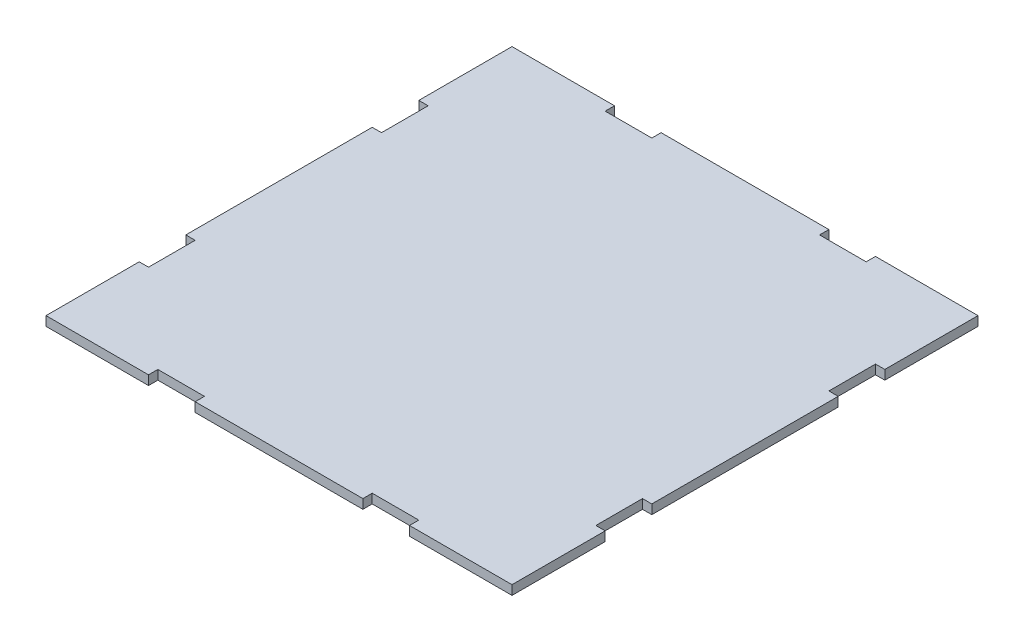
ISO-10303-21;
HEADER;
FILE_DESCRIPTION(('STEP AP214'),'2;1');
FILE_NAME('part.step','',(''),(''),'','','');
FILE_SCHEMA(('AUTOMOTIVE_DESIGN { 1 0 10303 214 1 1 1 1 }'));
ENDSEC;
DATA;
#1=APPLICATION_CONTEXT('core data for automotive mechanical design processes');
#2=APPLICATION_PROTOCOL_DEFINITION('international standard','automotive_design',2000,#1);
#3=PRODUCT_CONTEXT('',#1,'mechanical');
#4=PRODUCT('Part','Part','',(#3));
#5=PRODUCT_RELATED_PRODUCT_CATEGORY('part','',(#4));
#6=PRODUCT_DEFINITION_FORMATION('','',#4);
#7=PRODUCT_DEFINITION_CONTEXT('part definition',#1,'design');
#8=PRODUCT_DEFINITION('design','',#6,#7);
#9=PRODUCT_DEFINITION_SHAPE('','',#8);
#10=(LENGTH_UNIT() NAMED_UNIT(*) SI_UNIT(.MILLI.,.METRE.));
#11=(NAMED_UNIT(*) PLANE_ANGLE_UNIT() SI_UNIT($,.RADIAN.));
#12=(NAMED_UNIT(*) SI_UNIT($,.STERADIAN.) SOLID_ANGLE_UNIT());
#13=UNCERTAINTY_MEASURE_WITH_UNIT(LENGTH_MEASURE(1.E-05),#10,'distance_accuracy_value','');
#14=(GEOMETRIC_REPRESENTATION_CONTEXT(3) GLOBAL_UNCERTAINTY_ASSIGNED_CONTEXT((#13)) GLOBAL_UNIT_ASSIGNED_CONTEXT((#10,
#11,#12)) REPRESENTATION_CONTEXT('',''));
#15=CARTESIAN_POINT('',(0.,0.,0.));
#16=DIRECTION('',(0.,0.,1.));
#17=DIRECTION('',(1.,0.,0.));
#18=AXIS2_PLACEMENT_3D('',#15,#16,#17);
#19=CARTESIAN_POINT('',(0.,0.,0.));
#20=DIRECTION('',(0.,1.,0.));
#21=DIRECTION('',(0.,0.,1.));
#22=AXIS2_PLACEMENT_3D('',#19,#20,#21);
#23=PLANE('',#22);
#24=DIRECTION('',(0.,0.,-1.));
#25=VECTOR('',#24,1.);
#26=CARTESIAN_POINT('',(-18.,0.,48.));
#27=LINE('',#26,#25);
#28=CARTESIAN_POINT('',(-18.,0.,50.));
#29=VERTEX_POINT('',#28);
#30=CARTESIAN_POINT('',(-18.,0.,48.));
#31=VERTEX_POINT('',#30);
#32=EDGE_CURVE('E300',#29,#31,#27,.T.);
#33=ORIENTED_EDGE('',*,*,#32,.T.);
#34=DIRECTION('',(-1.,0.,0.));
#35=VECTOR('',#34,1.);
#36=CARTESIAN_POINT('',(-28.,0.,48.));
#37=LINE('',#36,#35);
#38=CARTESIAN_POINT('',(-28.,0.,48.));
#39=VERTEX_POINT('',#38);
#40=EDGE_CURVE('E303',#31,#39,#37,.T.);
#41=ORIENTED_EDGE('',*,*,#40,.T.);
#42=DIRECTION('',(0.,0.,1.));
#43=VECTOR('',#42,1.);
#44=CARTESIAN_POINT('',(-28.,0.,48.));
#45=LINE('',#44,#43);
#46=CARTESIAN_POINT('',(-28.,0.,50.));
#47=VERTEX_POINT('',#46);
#48=EDGE_CURVE('E307',#39,#47,#45,.T.);
#49=ORIENTED_EDGE('',*,*,#48,.T.);
#50=DIRECTION('',(1.,0.,0.));
#51=VECTOR('',#50,1.);
#52=CARTESIAN_POINT('',(-50.,0.,50.));
#53=LINE('',#52,#51);
#54=CARTESIAN_POINT('',(-50.,0.,50.));
#55=VERTEX_POINT('',#54);
#56=EDGE_CURVE('E490',#55,#47,#53,.T.);
#57=ORIENTED_EDGE('',*,*,#56,.F.);
#58=DIRECTION('',(0.,0.,1.));
#59=VECTOR('',#58,1.);
#60=CARTESIAN_POINT('',(-50.,0.,-50.));
#61=LINE('',#60,#59);
#62=CARTESIAN_POINT('',(-50.,0.,30.));
#63=VERTEX_POINT('',#62);
#64=EDGE_CURVE('E489',#63,#55,#61,.T.);
#65=ORIENTED_EDGE('',*,*,#64,.F.);
#66=DIRECTION('',(-1.,0.,0.));
#67=VECTOR('',#66,1.);
#68=CARTESIAN_POINT('',(-50.,0.,30.));
#69=LINE('',#68,#67);
#70=CARTESIAN_POINT('',(-48.,0.,30.));
#71=VERTEX_POINT('',#70);
#72=EDGE_CURVE('E375',#71,#63,#69,.T.);
#73=ORIENTED_EDGE('',*,*,#72,.F.);
#74=DIRECTION('',(0.,0.,1.));
#75=VECTOR('',#74,1.);
#76=CARTESIAN_POINT('',(-48.,0.,30.));
#77=LINE('',#76,#75);
#78=CARTESIAN_POINT('',(-48.,0.,20.));
#79=VERTEX_POINT('',#78);
#80=EDGE_CURVE('E370',#79,#71,#77,.T.);
#81=ORIENTED_EDGE('',*,*,#80,.F.);
#82=DIRECTION('',(1.,0.,0.));
#83=VECTOR('',#82,1.);
#84=CARTESIAN_POINT('',(-50.,0.,20.));
#85=LINE('',#84,#83);
#86=CARTESIAN_POINT('',(-50.,0.,20.));
#87=VERTEX_POINT('',#86);
#88=EDGE_CURVE('E372',#87,#79,#85,.T.);
#89=ORIENTED_EDGE('',*,*,#88,.F.);
#90=CARTESIAN_POINT('',(-50.,0.,-20.));
#91=VERTEX_POINT('',#90);
#92=EDGE_CURVE('E488',#91,#87,#61,.T.);
#93=ORIENTED_EDGE('',*,*,#92,.F.);
#94=DIRECTION('',(1.,0.,0.));
#95=VECTOR('',#94,1.);
#96=CARTESIAN_POINT('',(-50.,0.,-20.));
#97=LINE('',#96,#95);
#98=CARTESIAN_POINT('',(-48.,0.,-20.));
#99=VERTEX_POINT('',#98);
#100=EDGE_CURVE('E395',#91,#99,#97,.T.);
#101=ORIENTED_EDGE('',*,*,#100,.T.);
#102=DIRECTION('',(0.,0.,-1.));
#103=VECTOR('',#102,1.);
#104=CARTESIAN_POINT('',(-48.,0.,-30.));
#105=LINE('',#104,#103);
#106=CARTESIAN_POINT('',(-48.,0.,-30.));
#107=VERTEX_POINT('',#106);
#108=EDGE_CURVE('E391',#99,#107,#105,.T.);
#109=ORIENTED_EDGE('',*,*,#108,.T.);
#110=DIRECTION('',(-1.,0.,0.));
#111=VECTOR('',#110,1.);
#112=CARTESIAN_POINT('',(-50.,0.,-30.));
#113=LINE('',#112,#111);
#114=CARTESIAN_POINT('',(-50.,0.,-30.));
#115=VERTEX_POINT('',#114);
#116=EDGE_CURVE('E394',#107,#115,#113,.T.);
#117=ORIENTED_EDGE('',*,*,#116,.T.);
#118=CARTESIAN_POINT('',(-50.,0.,-50.));
#119=VERTEX_POINT('',#118);
#120=EDGE_CURVE('E484',#119,#115,#61,.T.);
#121=ORIENTED_EDGE('',*,*,#120,.F.);
#122=DIRECTION('',(1.,0.,0.));
#123=VECTOR('',#122,1.);
#124=CARTESIAN_POINT('',(-50.,0.,-50.));
#125=LINE('',#124,#123);
#126=CARTESIAN_POINT('',(-28.,0.,-50.));
#127=VERTEX_POINT('',#126);
#128=EDGE_CURVE('E500',#119,#127,#125,.T.);
#129=ORIENTED_EDGE('',*,*,#128,.T.);
#130=DIRECTION('',(0.,0.,-1.));
#131=VECTOR('',#130,1.);
#132=CARTESIAN_POINT('',(-28.,0.,-50.));
#133=LINE('',#132,#131);
#134=CARTESIAN_POINT('',(-28.,0.,-48.));
#135=VERTEX_POINT('',#134);
#136=EDGE_CURVE('E326',#135,#127,#133,.T.);
#137=ORIENTED_EDGE('',*,*,#136,.F.);
#138=DIRECTION('',(-1.,0.,0.));
#139=VECTOR('',#138,1.);
#140=CARTESIAN_POINT('',(-28.,0.,-48.));
#141=LINE('',#140,#139);
#142=CARTESIAN_POINT('',(-18.,0.,-48.));
#143=VERTEX_POINT('',#142);
#144=EDGE_CURVE('E329',#143,#135,#141,.T.);
#145=ORIENTED_EDGE('',*,*,#144,.F.);
#146=DIRECTION('',(0.,0.,1.));
#147=VECTOR('',#146,1.);
#148=CARTESIAN_POINT('',(-18.,0.,-50.));
#149=LINE('',#148,#147);
#150=CARTESIAN_POINT('',(-18.,0.,-50.));
#151=VERTEX_POINT('',#150);
#152=EDGE_CURVE('E324',#151,#143,#149,.T.);
#153=ORIENTED_EDGE('',*,*,#152,.F.);
#154=CARTESIAN_POINT('',(18.,0.,-50.));
#155=VERTEX_POINT('',#154);
#156=EDGE_CURVE('E503',#151,#155,#125,.T.);
#157=ORIENTED_EDGE('',*,*,#156,.T.);
#158=DIRECTION('',(0.,0.,1.));
#159=VECTOR('',#158,1.);
#160=CARTESIAN_POINT('',(18.,0.,-50.));
#161=LINE('',#160,#159);
#162=CARTESIAN_POINT('',(18.,0.,-48.));
#163=VERTEX_POINT('',#162);
#164=EDGE_CURVE('E345',#155,#163,#161,.T.);
#165=ORIENTED_EDGE('',*,*,#164,.T.);
#166=DIRECTION('',(1.,0.,0.));
#167=VECTOR('',#166,1.);
#168=CARTESIAN_POINT('',(28.,0.,-48.));
#169=LINE('',#168,#167);
#170=CARTESIAN_POINT('',(28.,0.,-48.));
#171=VERTEX_POINT('',#170);
#172=EDGE_CURVE('E348',#163,#171,#169,.T.);
#173=ORIENTED_EDGE('',*,*,#172,.T.);
#174=DIRECTION('',(0.,0.,-1.));
#175=VECTOR('',#174,1.);
#176=CARTESIAN_POINT('',(28.,0.,-50.));
#177=LINE('',#176,#175);
#178=CARTESIAN_POINT('',(28.,0.,-50.));
#179=VERTEX_POINT('',#178);
#180=EDGE_CURVE('E352',#171,#179,#177,.T.);
#181=ORIENTED_EDGE('',*,*,#180,.T.);
#182=CARTESIAN_POINT('',(50.,0.,-50.));
#183=VERTEX_POINT('',#182);
#184=EDGE_CURVE('E498',#179,#183,#125,.T.);
#185=ORIENTED_EDGE('',*,*,#184,.T.);
#186=DIRECTION('',(0.,0.,1.));
#187=VECTOR('',#186,1.);
#188=CARTESIAN_POINT('',(50.,0.,-50.));
#189=LINE('',#188,#187);
#190=CARTESIAN_POINT('',(50.,0.,-30.));
#191=VERTEX_POINT('',#190);
#192=EDGE_CURVE('E495',#183,#191,#189,.T.);
#193=ORIENTED_EDGE('',*,*,#192,.T.);
#194=DIRECTION('',(1.,0.,0.));
#195=VECTOR('',#194,1.);
#196=CARTESIAN_POINT('',(50.,0.,-30.));
#197=LINE('',#196,#195);
#198=CARTESIAN_POINT('',(48.,0.,-30.));
#199=VERTEX_POINT('',#198);
#200=EDGE_CURVE('E422',#199,#191,#197,.T.);
#201=ORIENTED_EDGE('',*,*,#200,.F.);
#202=DIRECTION('',(0.,0.,-1.));
#203=VECTOR('',#202,1.);
#204=CARTESIAN_POINT('',(48.,0.,-30.));
#205=LINE('',#204,#203);
#206=CARTESIAN_POINT('',(48.,0.,-20.));
#207=VERTEX_POINT('',#206);
#208=EDGE_CURVE('E416',#207,#199,#205,.T.);
#209=ORIENTED_EDGE('',*,*,#208,.F.);
#210=DIRECTION('',(-1.,0.,0.));
#211=VECTOR('',#210,1.);
#212=CARTESIAN_POINT('',(50.,0.,-20.));
#213=LINE('',#212,#211);
#214=CARTESIAN_POINT('',(50.,0.,-20.));
#215=VERTEX_POINT('',#214);
#216=EDGE_CURVE('E419',#215,#207,#213,.T.);
#217=ORIENTED_EDGE('',*,*,#216,.F.);
#218=CARTESIAN_POINT('',(50.,0.,20.));
#219=VERTEX_POINT('',#218);
#220=EDGE_CURVE('E499',#215,#219,#189,.T.);
#221=ORIENTED_EDGE('',*,*,#220,.T.);
#222=DIRECTION('',(-1.,0.,0.));
#223=VECTOR('',#222,1.);
#224=CARTESIAN_POINT('',(50.,0.,20.));
#225=LINE('',#224,#223);
#226=CARTESIAN_POINT('',(48.,0.,20.));
#227=VERTEX_POINT('',#226);
#228=EDGE_CURVE('E442',#219,#227,#225,.T.);
#229=ORIENTED_EDGE('',*,*,#228,.T.);
#230=DIRECTION('',(0.,0.,1.));
#231=VECTOR('',#230,1.);
#232=CARTESIAN_POINT('',(48.,0.,30.));
#233=LINE('',#232,#231);
#234=CARTESIAN_POINT('',(48.,0.,30.));
#235=VERTEX_POINT('',#234);
#236=EDGE_CURVE('E438',#227,#235,#233,.T.);
#237=ORIENTED_EDGE('',*,*,#236,.T.);
#238=DIRECTION('',(1.,0.,0.));
#239=VECTOR('',#238,1.);
#240=CARTESIAN_POINT('',(50.,0.,30.));
#241=LINE('',#240,#239);
#242=CARTESIAN_POINT('',(50.,0.,30.));
#243=VERTEX_POINT('',#242);
#244=EDGE_CURVE('E441',#235,#243,#241,.T.);
#245=ORIENTED_EDGE('',*,*,#244,.T.);
#246=CARTESIAN_POINT('',(50.,0.,50.));
#247=VERTEX_POINT('',#246);
#248=EDGE_CURVE('E493',#243,#247,#189,.T.);
#249=ORIENTED_EDGE('',*,*,#248,.T.);
#250=CARTESIAN_POINT('',(28.,0.,50.));
#251=VERTEX_POINT('',#250);
#252=EDGE_CURVE('E487',#251,#247,#53,.T.);
#253=ORIENTED_EDGE('',*,*,#252,.F.);
#254=DIRECTION('',(0.,0.,1.));
#255=VECTOR('',#254,1.);
#256=CARTESIAN_POINT('',(28.,0.,48.));
#257=LINE('',#256,#255);
#258=CARTESIAN_POINT('',(28.,0.,48.));
#259=VERTEX_POINT('',#258);
#260=EDGE_CURVE('E299',#259,#251,#257,.T.);
#261=ORIENTED_EDGE('',*,*,#260,.F.);
#262=DIRECTION('',(1.,0.,0.));
#263=VECTOR('',#262,1.);
#264=CARTESIAN_POINT('',(28.,0.,48.));
#265=LINE('',#264,#263);
#266=CARTESIAN_POINT('',(18.,0.,48.));
#267=VERTEX_POINT('',#266);
#268=EDGE_CURVE('E296',#267,#259,#265,.T.);
#269=ORIENTED_EDGE('',*,*,#268,.F.);
#270=DIRECTION('',(0.,0.,-1.));
#271=VECTOR('',#270,1.);
#272=CARTESIAN_POINT('',(18.,0.,48.));
#273=LINE('',#272,#271);
#274=CARTESIAN_POINT('',(18.,0.,50.));
#275=VERTEX_POINT('',#274);
#276=EDGE_CURVE('E279',#275,#267,#273,.T.);
#277=ORIENTED_EDGE('',*,*,#276,.F.);
#278=EDGE_CURVE('E494',#29,#275,#53,.T.);
#279=ORIENTED_EDGE('',*,*,#278,.F.);
#280=EDGE_LOOP('',(#33,#41,#49,#57,#65,#73,#81,#89,#93,#101,#109,#117,#121,#129,#137,#145,#153,
#157,#165,#173,#181,#185,#193,#201,#209,#217,#221,#229,#237,#245,#249,#253,#261,#269,#277,#279));
#281=FACE_BOUND('',#280,.T.);
#282=ADVANCED_FACE('F34',(#281),#23,.F.);
#283=CARTESIAN_POINT('',(0.,2.,0.));
#284=DIRECTION('',(0.,1.,0.));
#285=DIRECTION('',(0.,0.,1.));
#286=AXIS2_PLACEMENT_3D('',#283,#284,#285);
#287=PLANE('',#286);
#288=DIRECTION('',(1.,0.,0.));
#289=VECTOR('',#288,1.);
#290=CARTESIAN_POINT('',(-50.,2.,50.));
#291=LINE('',#290,#289);
#292=CARTESIAN_POINT('',(28.,2.,50.));
#293=VERTEX_POINT('',#292);
#294=CARTESIAN_POINT('',(50.,2.,50.));
#295=VERTEX_POINT('',#294);
#296=EDGE_CURVE('E470',#293,#295,#291,.T.);
#297=ORIENTED_EDGE('',*,*,#296,.T.);
#298=DIRECTION('',(0.,0.,1.));
#299=VECTOR('',#298,1.);
#300=CARTESIAN_POINT('',(50.,2.,-50.));
#301=LINE('',#300,#299);
#302=CARTESIAN_POINT('',(50.,2.,30.));
#303=VERTEX_POINT('',#302);
#304=EDGE_CURVE('E474',#303,#295,#301,.T.);
#305=ORIENTED_EDGE('',*,*,#304,.F.);
#306=DIRECTION('',(-1.,0.,0.));
#307=VECTOR('',#306,1.);
#308=CARTESIAN_POINT('',(50.,2.,30.));
#309=LINE('',#308,#307);
#310=CARTESIAN_POINT('',(48.,2.,30.));
#311=VERTEX_POINT('',#310);
#312=EDGE_CURVE('E437',#303,#311,#309,.T.);
#313=ORIENTED_EDGE('',*,*,#312,.T.);
#314=DIRECTION('',(0.,0.,-1.));
#315=VECTOR('',#314,1.);
#316=CARTESIAN_POINT('',(48.,2.,0.));
#317=LINE('',#316,#315);
#318=CARTESIAN_POINT('',(48.,2.,20.));
#319=VERTEX_POINT('',#318);
#320=EDGE_CURVE('E466',#311,#319,#317,.T.);
#321=ORIENTED_EDGE('',*,*,#320,.T.);
#322=DIRECTION('',(1.,0.,0.));
#323=VECTOR('',#322,1.);
#324=CARTESIAN_POINT('',(50.,2.,20.));
#325=LINE('',#324,#323);
#326=CARTESIAN_POINT('',(50.,2.,20.));
#327=VERTEX_POINT('',#326);
#328=EDGE_CURVE('E448',#319,#327,#325,.T.);
#329=ORIENTED_EDGE('',*,*,#328,.T.);
#330=CARTESIAN_POINT('',(50.,2.,-20.));
#331=VERTEX_POINT('',#330);
#332=EDGE_CURVE('E479',#331,#327,#301,.T.);
#333=ORIENTED_EDGE('',*,*,#332,.F.);
#334=DIRECTION('',(1.,0.,0.));
#335=VECTOR('',#334,1.);
#336=CARTESIAN_POINT('',(50.,2.,-20.));
#337=LINE('',#336,#335);
#338=CARTESIAN_POINT('',(48.,2.,-20.));
#339=VERTEX_POINT('',#338);
#340=EDGE_CURVE('E398',#339,#331,#337,.T.);
#341=ORIENTED_EDGE('',*,*,#340,.F.);
#342=CARTESIAN_POINT('',(48.,2.,-30.));
#343=VERTEX_POINT('',#342);
#344=EDGE_CURVE('E445',#339,#343,#317,.T.);
#345=ORIENTED_EDGE('',*,*,#344,.T.);
#346=DIRECTION('',(-1.,0.,0.));
#347=VECTOR('',#346,1.);
#348=CARTESIAN_POINT('',(50.,2.,-30.));
#349=LINE('',#348,#347);
#350=CARTESIAN_POINT('',(50.,2.,-30.));
#351=VERTEX_POINT('',#350);
#352=EDGE_CURVE('E424',#351,#343,#349,.T.);
#353=ORIENTED_EDGE('',*,*,#352,.F.);
#354=CARTESIAN_POINT('',(50.,2.,-50.));
#355=VERTEX_POINT('',#354);
#356=EDGE_CURVE('E475',#355,#351,#301,.T.);
#357=ORIENTED_EDGE('',*,*,#356,.F.);
#358=DIRECTION('',(1.,0.,0.));
#359=VECTOR('',#358,1.);
#360=CARTESIAN_POINT('',(-50.,2.,-50.));
#361=LINE('',#360,#359);
#362=CARTESIAN_POINT('',(28.,2.,-50.));
#363=VERTEX_POINT('',#362);
#364=EDGE_CURVE('E478',#363,#355,#361,.T.);
#365=ORIENTED_EDGE('',*,*,#364,.F.);
#366=DIRECTION('',(0.,0.,1.));
#367=VECTOR('',#366,1.);
#368=CARTESIAN_POINT('',(28.,2.,-50.));
#369=LINE('',#368,#367);
#370=CARTESIAN_POINT('',(28.,2.,-48.));
#371=VERTEX_POINT('',#370);
#372=EDGE_CURVE('E344',#363,#371,#369,.T.);
#373=ORIENTED_EDGE('',*,*,#372,.T.);
#374=DIRECTION('',(-1.,0.,0.));
#375=VECTOR('',#374,1.);
#376=CARTESIAN_POINT('',(0.,2.,-48.));
#377=LINE('',#376,#375);
#378=CARTESIAN_POINT('',(18.,2.,-48.));
#379=VERTEX_POINT('',#378);
#380=EDGE_CURVE('E276',#371,#379,#377,.T.);
#381=ORIENTED_EDGE('',*,*,#380,.T.);
#382=DIRECTION('',(0.,0.,-1.));
#383=VECTOR('',#382,1.);
#384=CARTESIAN_POINT('',(18.,2.,-50.));
#385=LINE('',#384,#383);
#386=CARTESIAN_POINT('',(18.,2.,-50.));
#387=VERTEX_POINT('',#386);
#388=EDGE_CURVE('E358',#379,#387,#385,.T.);
#389=ORIENTED_EDGE('',*,*,#388,.T.);
#390=CARTESIAN_POINT('',(-18.,2.,-50.));
#391=VERTEX_POINT('',#390);
#392=EDGE_CURVE('E483',#391,#387,#361,.T.);
#393=ORIENTED_EDGE('',*,*,#392,.F.);
#394=DIRECTION('',(0.,0.,-1.));
#395=VECTOR('',#394,1.);
#396=CARTESIAN_POINT('',(-18.,2.,-50.));
#397=LINE('',#396,#395);
#398=CARTESIAN_POINT('',(-18.,2.,-48.));
#399=VERTEX_POINT('',#398);
#400=EDGE_CURVE('E332',#399,#391,#397,.T.);
#401=ORIENTED_EDGE('',*,*,#400,.F.);
#402=CARTESIAN_POINT('',(-28.,2.,-48.));
#403=VERTEX_POINT('',#402);
#404=EDGE_CURVE('E517',#399,#403,#377,.T.);
#405=ORIENTED_EDGE('',*,*,#404,.T.);
#406=DIRECTION('',(0.,0.,1.));
#407=VECTOR('',#406,1.);
#408=CARTESIAN_POINT('',(-28.,2.,-50.));
#409=LINE('',#408,#407);
#410=CARTESIAN_POINT('',(-28.,2.,-50.));
#411=VERTEX_POINT('',#410);
#412=EDGE_CURVE('E310',#411,#403,#409,.T.);
#413=ORIENTED_EDGE('',*,*,#412,.F.);
#414=CARTESIAN_POINT('',(-50.,2.,-50.));
#415=VERTEX_POINT('',#414);
#416=EDGE_CURVE('E480',#415,#411,#361,.T.);
#417=ORIENTED_EDGE('',*,*,#416,.F.);
#418=DIRECTION('',(0.,0.,1.));
#419=VECTOR('',#418,1.);
#420=CARTESIAN_POINT('',(-50.,2.,-50.));
#421=LINE('',#420,#419);
#422=CARTESIAN_POINT('',(-50.,2.,-30.));
#423=VERTEX_POINT('',#422);
#424=EDGE_CURVE('E467',#415,#423,#421,.T.);
#425=ORIENTED_EDGE('',*,*,#424,.T.);
#426=DIRECTION('',(1.,0.,0.));
#427=VECTOR('',#426,1.);
#428=CARTESIAN_POINT('',(-50.,2.,-30.));
#429=LINE('',#428,#427);
#430=CARTESIAN_POINT('',(-48.,2.,-30.));
#431=VERTEX_POINT('',#430);
#432=EDGE_CURVE('E390',#423,#431,#429,.T.);
#433=ORIENTED_EDGE('',*,*,#432,.T.);
#434=DIRECTION('',(0.,0.,1.));
#435=VECTOR('',#434,1.);
#436=CARTESIAN_POINT('',(-48.,2.,0.));
#437=LINE('',#436,#435);
#438=CARTESIAN_POINT('',(-48.,2.,-20.));
#439=VERTEX_POINT('',#438);
#440=EDGE_CURVE('E515',#431,#439,#437,.T.);
#441=ORIENTED_EDGE('',*,*,#440,.T.);
#442=DIRECTION('',(-1.,0.,0.));
#443=VECTOR('',#442,1.);
#444=CARTESIAN_POINT('',(-50.,2.,-20.));
#445=LINE('',#444,#443);
#446=CARTESIAN_POINT('',(-50.,2.,-20.));
#447=VERTEX_POINT('',#446);
#448=EDGE_CURVE('E401',#439,#447,#445,.T.);
#449=ORIENTED_EDGE('',*,*,#448,.T.);
#450=CARTESIAN_POINT('',(-50.,2.,20.));
#451=VERTEX_POINT('',#450);
#452=EDGE_CURVE('E471',#447,#451,#421,.T.);
#453=ORIENTED_EDGE('',*,*,#452,.T.);
#454=DIRECTION('',(-1.,0.,0.));
#455=VECTOR('',#454,1.);
#456=CARTESIAN_POINT('',(-50.,2.,20.));
#457=LINE('',#456,#455);
#458=CARTESIAN_POINT('',(-48.,2.,20.));
#459=VERTEX_POINT('',#458);
#460=EDGE_CURVE('E355',#459,#451,#457,.T.);
#461=ORIENTED_EDGE('',*,*,#460,.F.);
#462=CARTESIAN_POINT('',(-48.,2.,30.));
#463=VERTEX_POINT('',#462);
#464=EDGE_CURVE('E514',#459,#463,#437,.T.);
#465=ORIENTED_EDGE('',*,*,#464,.T.);
#466=DIRECTION('',(1.,0.,0.));
#467=VECTOR('',#466,1.);
#468=CARTESIAN_POINT('',(-50.,2.,30.));
#469=LINE('',#468,#467);
#470=CARTESIAN_POINT('',(-50.,2.,30.));
#471=VERTEX_POINT('',#470);
#472=EDGE_CURVE('E377',#471,#463,#469,.T.);
#473=ORIENTED_EDGE('',*,*,#472,.F.);
#474=CARTESIAN_POINT('',(-50.,2.,50.));
#475=VERTEX_POINT('',#474);
#476=EDGE_CURVE('E472',#471,#475,#421,.T.);
#477=ORIENTED_EDGE('',*,*,#476,.T.);
#478=CARTESIAN_POINT('',(-28.,2.,50.));
#479=VERTEX_POINT('',#478);
#480=EDGE_CURVE('E57',#475,#479,#291,.T.);
#481=ORIENTED_EDGE('',*,*,#480,.T.);
#482=DIRECTION('',(0.,0.,-1.));
#483=VECTOR('',#482,1.);
#484=CARTESIAN_POINT('',(-28.,2.,48.));
#485=LINE('',#484,#483);
#486=CARTESIAN_POINT('',(-28.,2.,48.));
#487=VERTEX_POINT('',#486);
#488=EDGE_CURVE('E298',#479,#487,#485,.T.);
#489=ORIENTED_EDGE('',*,*,#488,.T.);
#490=DIRECTION('',(1.,0.,0.));
#491=VECTOR('',#490,1.);
#492=CARTESIAN_POINT('',(0.,2.,48.));
#493=LINE('',#492,#491);
#494=CARTESIAN_POINT('',(-18.,2.,48.));
#495=VERTEX_POINT('',#494);
#496=EDGE_CURVE('E11',#487,#495,#493,.T.);
#497=ORIENTED_EDGE('',*,*,#496,.T.);
#498=DIRECTION('',(0.,0.,1.));
#499=VECTOR('',#498,1.);
#500=CARTESIAN_POINT('',(-18.,2.,48.));
#501=LINE('',#500,#499);
#502=CARTESIAN_POINT('',(-18.,2.,50.));
#503=VERTEX_POINT('',#502);
#504=EDGE_CURVE('E312',#495,#503,#501,.T.);
#505=ORIENTED_EDGE('',*,*,#504,.T.);
#506=CARTESIAN_POINT('',(18.,2.,50.));
#507=VERTEX_POINT('',#506);
#508=EDGE_CURVE('E286',#503,#507,#291,.T.);
#509=ORIENTED_EDGE('',*,*,#508,.T.);
#510=DIRECTION('',(0.,0.,1.));
#511=VECTOR('',#510,1.);
#512=CARTESIAN_POINT('',(18.,2.,48.));
#513=LINE('',#512,#511);
#514=CARTESIAN_POINT('',(18.,2.,48.));
#515=VERTEX_POINT('',#514);
#516=EDGE_CURVE('E49',#515,#507,#513,.T.);
#517=ORIENTED_EDGE('',*,*,#516,.F.);
#518=CARTESIAN_POINT('',(28.,2.,48.));
#519=VERTEX_POINT('',#518);
#520=EDGE_CURVE('E38',#515,#519,#493,.T.);
#521=ORIENTED_EDGE('',*,*,#520,.T.);
#522=DIRECTION('',(0.,0.,-1.));
#523=VECTOR('',#522,1.);
#524=CARTESIAN_POINT('',(28.,2.,48.));
#525=LINE('',#524,#523);
#526=EDGE_CURVE('E287',#293,#519,#525,.T.);
#527=ORIENTED_EDGE('',*,*,#526,.F.);
#528=EDGE_LOOP('',(#297,#305,#313,#321,#329,#333,#341,#345,#353,#357,#365,#373,#381,#389,#393,
#401,#405,#413,#417,#425,#433,#441,#449,#453,#461,#465,#473,#477,#481,#489,#497,#505,#509,#517,
#521,#527));
#529=FACE_BOUND('',#528,.T.);
#530=ADVANCED_FACE('F283',(#529),#287,.T.);
#531=CARTESIAN_POINT('',(-50.,2.,50.));
#532=DIRECTION('',(0.,0.,-1.));
#533=DIRECTION('',(-1.,0.,0.));
#534=AXIS2_PLACEMENT_3D('',#531,#532,#533);
#535=PLANE('',#534);
#536=DIRECTION('',(0.,1.,0.));
#537=VECTOR('',#536,1.);
#538=CARTESIAN_POINT('',(-18.,-10.1980390271856,50.));
#539=LINE('',#538,#537);
#540=EDGE_CURVE('E317',#29,#503,#539,.T.);
#541=ORIENTED_EDGE('',*,*,#540,.F.);
#542=ORIENTED_EDGE('',*,*,#278,.T.);
#543=DIRECTION('',(0.,1.,0.));
#544=VECTOR('',#543,1.);
#545=CARTESIAN_POINT('',(18.,-10.1980390271856,50.));
#546=LINE('',#545,#544);
#547=EDGE_CURVE('E280',#275,#507,#546,.T.);
#548=ORIENTED_EDGE('',*,*,#547,.T.);
#549=ORIENTED_EDGE('',*,*,#508,.F.);
#550=EDGE_LOOP('',(#541,#542,#548,#549));
#551=FACE_BOUND('',#550,.T.);
#552=ADVANCED_FACE('F585',(#551),#535,.F.);
#553=DIRECTION('',(0.,1.,0.));
#554=VECTOR('',#553,1.);
#555=CARTESIAN_POINT('',(-28.,-10.1980390271856,50.));
#556=LINE('',#555,#554);
#557=EDGE_CURVE('E314',#47,#479,#556,.T.);
#558=ORIENTED_EDGE('',*,*,#557,.T.);
#559=ORIENTED_EDGE('',*,*,#480,.F.);
#560=DIRECTION('',(0.,-1.,0.));
#561=VECTOR('',#560,1.);
#562=CARTESIAN_POINT('',(-50.,2.,50.));
#563=LINE('',#562,#561);
#564=EDGE_CURVE('E511',#475,#55,#563,.T.);
#565=ORIENTED_EDGE('',*,*,#564,.T.);
#566=ORIENTED_EDGE('',*,*,#56,.T.);
#567=EDGE_LOOP('',(#558,#559,#565,#566));
#568=FACE_BOUND('',#567,.T.);
#569=ADVANCED_FACE('F623',(#568),#535,.F.);
#570=ORIENTED_EDGE('',*,*,#296,.F.);
#571=DIRECTION('',(0.,1.,0.));
#572=VECTOR('',#571,1.);
#573=CARTESIAN_POINT('',(28.,-10.1980390271856,50.));
#574=LINE('',#573,#572);
#575=EDGE_CURVE('E294',#251,#293,#574,.T.);
#576=ORIENTED_EDGE('',*,*,#575,.F.);
#577=ORIENTED_EDGE('',*,*,#252,.T.);
#578=DIRECTION('',(0.,-1.,0.));
#579=VECTOR('',#578,1.);
#580=CARTESIAN_POINT('',(50.,2.,50.));
#581=LINE('',#580,#579);
#582=EDGE_CURVE('E508',#295,#247,#581,.T.);
#583=ORIENTED_EDGE('',*,*,#582,.F.);
#584=EDGE_LOOP('',(#570,#576,#577,#583));
#585=FACE_BOUND('',#584,.T.);
#586=ADVANCED_FACE('F579',(#585),#535,.F.);
#587=CARTESIAN_POINT('',(-50.,2.,-50.));
#588=DIRECTION('',(0.,0.,-1.));
#589=DIRECTION('',(-1.,0.,0.));
#590=AXIS2_PLACEMENT_3D('',#587,#588,#589);
#591=PLANE('',#590);
#592=ORIENTED_EDGE('',*,*,#392,.T.);
#593=DIRECTION('',(0.,1.,0.));
#594=VECTOR('',#593,1.);
#595=CARTESIAN_POINT('',(18.,-10.1980390271856,-50.));
#596=LINE('',#595,#594);
#597=EDGE_CURVE('E364',#155,#387,#596,.T.);
#598=ORIENTED_EDGE('',*,*,#597,.F.);
#599=ORIENTED_EDGE('',*,*,#156,.F.);
#600=DIRECTION('',(0.,1.,0.));
#601=VECTOR('',#600,1.);
#602=CARTESIAN_POINT('',(-18.,-10.1980390271856,-50.));
#603=LINE('',#602,#601);
#604=EDGE_CURVE('E338',#151,#391,#603,.T.);
#605=ORIENTED_EDGE('',*,*,#604,.T.);
#606=EDGE_LOOP('',(#592,#598,#599,#605));
#607=FACE_BOUND('',#606,.T.);
#608=ADVANCED_FACE('F617',(#607),#591,.T.);
#609=ORIENTED_EDGE('',*,*,#184,.F.);
#610=DIRECTION('',(0.,1.,0.));
#611=VECTOR('',#610,1.);
#612=CARTESIAN_POINT('',(28.,-10.1980390271856,-50.));
#613=LINE('',#612,#611);
#614=EDGE_CURVE('E361',#179,#363,#613,.T.);
#615=ORIENTED_EDGE('',*,*,#614,.T.);
#616=ORIENTED_EDGE('',*,*,#364,.T.);
#617=DIRECTION('',(0.,-1.,0.));
#618=VECTOR('',#617,1.);
#619=CARTESIAN_POINT('',(50.,2.,-50.));
#620=LINE('',#619,#618);
#621=EDGE_CURVE('E505',#355,#183,#620,.T.);
#622=ORIENTED_EDGE('',*,*,#621,.T.);
#623=EDGE_LOOP('',(#609,#615,#616,#622));
#624=FACE_BOUND('',#623,.T.);
#625=ADVANCED_FACE('F545',(#624),#591,.T.);
#626=DIRECTION('',(0.,1.,0.));
#627=VECTOR('',#626,1.);
#628=CARTESIAN_POINT('',(-28.,-10.1980390271856,-50.));
#629=LINE('',#628,#627);
#630=EDGE_CURVE('E327',#127,#411,#629,.T.);
#631=ORIENTED_EDGE('',*,*,#630,.F.);
#632=ORIENTED_EDGE('',*,*,#128,.F.);
#633=DIRECTION('',(0.,-1.,0.));
#634=VECTOR('',#633,1.);
#635=CARTESIAN_POINT('',(-50.,2.,-50.));
#636=LINE('',#635,#634);
#637=EDGE_CURVE('E482',#415,#119,#636,.T.);
#638=ORIENTED_EDGE('',*,*,#637,.F.);
#639=ORIENTED_EDGE('',*,*,#416,.T.);
#640=EDGE_LOOP('',(#631,#632,#638,#639));
#641=FACE_BOUND('',#640,.T.);
#642=ADVANCED_FACE('F620',(#641),#591,.T.);
#643=CARTESIAN_POINT('',(-50.,2.,-50.));
#644=DIRECTION('',(1.,0.,0.));
#645=DIRECTION('',(0.,0.,-1.));
#646=AXIS2_PLACEMENT_3D('',#643,#644,#645);
#647=PLANE('',#646);
#648=DIRECTION('',(0.,1.,0.));
#649=VECTOR('',#648,1.);
#650=CARTESIAN_POINT('',(-50.,-10.1980390271856,-20.));
#651=LINE('',#650,#649);
#652=EDGE_CURVE('E404',#91,#447,#651,.T.);
#653=ORIENTED_EDGE('',*,*,#652,.F.);
#654=ORIENTED_EDGE('',*,*,#92,.T.);
#655=DIRECTION('',(0.,1.,0.));
#656=VECTOR('',#655,1.);
#657=CARTESIAN_POINT('',(-50.,-10.1980390271856,20.));
#658=LINE('',#657,#656);
#659=EDGE_CURVE('E373',#87,#451,#658,.T.);
#660=ORIENTED_EDGE('',*,*,#659,.T.);
#661=ORIENTED_EDGE('',*,*,#452,.F.);
#662=EDGE_LOOP('',(#653,#654,#660,#661));
#663=FACE_BOUND('',#662,.T.);
#664=ADVANCED_FACE('F650',(#663),#647,.F.);
#665=DIRECTION('',(0.,1.,0.));
#666=VECTOR('',#665,1.);
#667=CARTESIAN_POINT('',(-50.,-10.1980390271856,-30.));
#668=LINE('',#667,#666);
#669=EDGE_CURVE('E411',#115,#423,#668,.T.);
#670=ORIENTED_EDGE('',*,*,#669,.T.);
#671=ORIENTED_EDGE('',*,*,#424,.F.);
#672=ORIENTED_EDGE('',*,*,#637,.T.);
#673=ORIENTED_EDGE('',*,*,#120,.T.);
#674=EDGE_LOOP('',(#670,#671,#672,#673));
#675=FACE_BOUND('',#674,.T.);
#676=ADVANCED_FACE('F658',(#675),#647,.F.);
#677=CARTESIAN_POINT('',(50.,2.,-50.));
#678=DIRECTION('',(1.,0.,0.));
#679=DIRECTION('',(0.,0.,-1.));
#680=AXIS2_PLACEMENT_3D('',#677,#678,#679);
#681=PLANE('',#680);
#682=ORIENTED_EDGE('',*,*,#332,.T.);
#683=DIRECTION('',(0.,1.,0.));
#684=VECTOR('',#683,1.);
#685=CARTESIAN_POINT('',(50.,-10.1980390271856,20.));
#686=LINE('',#685,#684);
#687=EDGE_CURVE('E451',#219,#327,#686,.T.);
#688=ORIENTED_EDGE('',*,*,#687,.F.);
#689=ORIENTED_EDGE('',*,*,#220,.F.);
#690=DIRECTION('',(0.,1.,0.));
#691=VECTOR('',#690,1.);
#692=CARTESIAN_POINT('',(50.,-10.1980390271856,-20.));
#693=LINE('',#692,#691);
#694=EDGE_CURVE('E420',#215,#331,#693,.T.);
#695=ORIENTED_EDGE('',*,*,#694,.T.);
#696=EDGE_LOOP('',(#682,#688,#689,#695));
#697=FACE_BOUND('',#696,.T.);
#698=ADVANCED_FACE('F567',(#697),#681,.T.);
#699=ORIENTED_EDGE('',*,*,#248,.F.);
#700=DIRECTION('',(0.,1.,0.));
#701=VECTOR('',#700,1.);
#702=CARTESIAN_POINT('',(50.,-10.1980390271856,30.));
#703=LINE('',#702,#701);
#704=EDGE_CURVE('E459',#243,#303,#703,.T.);
#705=ORIENTED_EDGE('',*,*,#704,.T.);
#706=ORIENTED_EDGE('',*,*,#304,.T.);
#707=ORIENTED_EDGE('',*,*,#582,.T.);
#708=EDGE_LOOP('',(#699,#705,#706,#707));
#709=FACE_BOUND('',#708,.T.);
#710=ADVANCED_FACE('F575',(#709),#681,.T.);
#711=ORIENTED_EDGE('',*,*,#476,.F.);
#712=DIRECTION('',(0.,1.,0.));
#713=VECTOR('',#712,1.);
#714=CARTESIAN_POINT('',(-50.,-10.1980390271856,30.));
#715=LINE('',#714,#713);
#716=EDGE_CURVE('E380',#63,#471,#715,.T.);
#717=ORIENTED_EDGE('',*,*,#716,.F.);
#718=ORIENTED_EDGE('',*,*,#64,.T.);
#719=ORIENTED_EDGE('',*,*,#564,.F.);
#720=EDGE_LOOP('',(#711,#717,#718,#719));
#721=FACE_BOUND('',#720,.T.);
#722=ADVANCED_FACE('F36',(#721),#647,.F.);
#723=DIRECTION('',(0.,1.,0.));
#724=VECTOR('',#723,1.);
#725=CARTESIAN_POINT('',(50.,-10.1980390271856,-30.));
#726=LINE('',#725,#724);
#727=EDGE_CURVE('E427',#191,#351,#726,.T.);
#728=ORIENTED_EDGE('',*,*,#727,.F.);
#729=ORIENTED_EDGE('',*,*,#192,.F.);
#730=ORIENTED_EDGE('',*,*,#621,.F.);
#731=ORIENTED_EDGE('',*,*,#356,.T.);
#732=EDGE_LOOP('',(#728,#729,#730,#731));
#733=FACE_BOUND('',#732,.T.);
#734=ADVANCED_FACE('F549',(#733),#681,.T.);
#735=CARTESIAN_POINT('',(50.,-10.1980390271856,-30.));
#736=DIRECTION('',(0.,0.,-1.));
#737=DIRECTION('',(0.,1.,0.));
#738=AXIS2_PLACEMENT_3D('',#735,#736,#737);
#739=PLANE('',#738);
#740=ORIENTED_EDGE('',*,*,#200,.T.);
#741=ORIENTED_EDGE('',*,*,#727,.T.);
#742=ORIENTED_EDGE('',*,*,#352,.T.);
#743=DIRECTION('',(0.,1.,0.));
#744=VECTOR('',#743,1.);
#745=CARTESIAN_POINT('',(48.,-10.1980390271856,-30.));
#746=LINE('',#745,#744);
#747=EDGE_CURVE('E429',#199,#343,#746,.T.);
#748=ORIENTED_EDGE('',*,*,#747,.F.);
#749=EDGE_LOOP('',(#740,#741,#742,#748));
#750=FACE_BOUND('',#749,.T.);
#751=ADVANCED_FACE('F552',(#750),#739,.F.);
#752=CARTESIAN_POINT('',(50.,-10.1980390271856,-20.));
#753=DIRECTION('',(0.,0.,1.));
#754=DIRECTION('',(0.,-1.,0.));
#755=AXIS2_PLACEMENT_3D('',#752,#753,#754);
#756=PLANE('',#755);
#757=ORIENTED_EDGE('',*,*,#216,.T.);
#758=DIRECTION('',(0.,1.,0.));
#759=VECTOR('',#758,1.);
#760=CARTESIAN_POINT('',(48.,-10.1980390271856,-20.));
#761=LINE('',#760,#759);
#762=EDGE_CURVE('E431',#207,#339,#761,.T.);
#763=ORIENTED_EDGE('',*,*,#762,.T.);
#764=ORIENTED_EDGE('',*,*,#340,.T.);
#765=ORIENTED_EDGE('',*,*,#694,.F.);
#766=EDGE_LOOP('',(#757,#763,#764,#765));
#767=FACE_BOUND('',#766,.T.);
#768=ADVANCED_FACE('F560',(#767),#756,.F.);
#769=CARTESIAN_POINT('',(48.,100.,-50.));
#770=DIRECTION('',(1.,0.,0.));
#771=DIRECTION('',(0.,0.,-1.));
#772=AXIS2_PLACEMENT_3D('',#769,#770,#771);
#773=PLANE('',#772);
#774=ORIENTED_EDGE('',*,*,#762,.F.);
#775=ORIENTED_EDGE('',*,*,#208,.T.);
#776=ORIENTED_EDGE('',*,*,#747,.T.);
#777=ORIENTED_EDGE('',*,*,#344,.F.);
#778=EDGE_LOOP('',(#774,#775,#776,#777));
#779=FACE_BOUND('',#778,.T.);
#780=ADVANCED_FACE('F557',(#779),#773,.T.);
#781=DIRECTION('',(0.,1.,0.));
#782=VECTOR('',#781,1.);
#783=CARTESIAN_POINT('',(48.,-10.1980390271856,30.));
#784=LINE('',#783,#782);
#785=EDGE_CURVE('E456',#235,#311,#784,.T.);
#786=ORIENTED_EDGE('',*,*,#785,.F.);
#787=ORIENTED_EDGE('',*,*,#236,.F.);
#788=DIRECTION('',(0.,1.,0.));
#789=VECTOR('',#788,1.);
#790=CARTESIAN_POINT('',(48.,-10.1980390271856,20.));
#791=LINE('',#790,#789);
#792=EDGE_CURVE('E453',#227,#319,#791,.T.);
#793=ORIENTED_EDGE('',*,*,#792,.T.);
#794=ORIENTED_EDGE('',*,*,#320,.F.);
#795=EDGE_LOOP('',(#786,#787,#793,#794));
#796=FACE_BOUND('',#795,.T.);
#797=ADVANCED_FACE('F595',(#796),#773,.T.);
#798=CARTESIAN_POINT('',(50.,-10.1980390271856,20.));
#799=DIRECTION('',(0.,0.,1.));
#800=DIRECTION('',(0.,-1.,0.));
#801=AXIS2_PLACEMENT_3D('',#798,#799,#800);
#802=PLANE('',#801);
#803=ORIENTED_EDGE('',*,*,#687,.T.);
#804=ORIENTED_EDGE('',*,*,#328,.F.);
#805=ORIENTED_EDGE('',*,*,#792,.F.);
#806=ORIENTED_EDGE('',*,*,#228,.F.);
#807=EDGE_LOOP('',(#803,#804,#805,#806));
#808=FACE_BOUND('',#807,.T.);
#809=ADVANCED_FACE('F592',(#808),#802,.T.);
#810=CARTESIAN_POINT('',(50.,-10.1980390271856,30.));
#811=DIRECTION('',(0.,0.,-1.));
#812=DIRECTION('',(0.,1.,0.));
#813=AXIS2_PLACEMENT_3D('',#810,#811,#812);
#814=PLANE('',#813);
#815=ORIENTED_EDGE('',*,*,#785,.T.);
#816=ORIENTED_EDGE('',*,*,#312,.F.);
#817=ORIENTED_EDGE('',*,*,#704,.F.);
#818=ORIENTED_EDGE('',*,*,#244,.F.);
#819=EDGE_LOOP('',(#815,#816,#817,#818));
#820=FACE_BOUND('',#819,.T.);
#821=ADVANCED_FACE('F597',(#820),#814,.T.);
#822=CARTESIAN_POINT('',(-50.,-10.1980390271856,30.));
#823=DIRECTION('',(0.,0.,1.));
#824=DIRECTION('',(0.,-1.,0.));
#825=AXIS2_PLACEMENT_3D('',#822,#823,#824);
#826=PLANE('',#825);
#827=ORIENTED_EDGE('',*,*,#72,.T.);
#828=ORIENTED_EDGE('',*,*,#716,.T.);
#829=ORIENTED_EDGE('',*,*,#472,.T.);
#830=DIRECTION('',(0.,1.,0.));
#831=VECTOR('',#830,1.);
#832=CARTESIAN_POINT('',(-48.,-10.1980390271856,30.));
#833=LINE('',#832,#831);
#834=EDGE_CURVE('E382',#71,#463,#833,.T.);
#835=ORIENTED_EDGE('',*,*,#834,.F.);
#836=EDGE_LOOP('',(#827,#828,#829,#835));
#837=FACE_BOUND('',#836,.T.);
#838=ADVANCED_FACE('F599',(#837),#826,.F.);
#839=CARTESIAN_POINT('',(-50.,-10.1980390271856,20.));
#840=DIRECTION('',(0.,0.,-1.));
#841=DIRECTION('',(0.,1.,0.));
#842=AXIS2_PLACEMENT_3D('',#839,#840,#841);
#843=PLANE('',#842);
#844=ORIENTED_EDGE('',*,*,#88,.T.);
#845=DIRECTION('',(0.,1.,0.));
#846=VECTOR('',#845,1.);
#847=CARTESIAN_POINT('',(-48.,-10.1980390271856,20.));
#848=LINE('',#847,#846);
#849=EDGE_CURVE('E384',#79,#459,#848,.T.);
#850=ORIENTED_EDGE('',*,*,#849,.T.);
#851=ORIENTED_EDGE('',*,*,#460,.T.);
#852=ORIENTED_EDGE('',*,*,#659,.F.);
#853=EDGE_LOOP('',(#844,#850,#851,#852));
#854=FACE_BOUND('',#853,.T.);
#855=ADVANCED_FACE('F605',(#854),#843,.F.);
#856=CARTESIAN_POINT('',(-48.,200.0199980004,-50.));
#857=DIRECTION('',(-1.,0.,0.));
#858=DIRECTION('',(0.,0.,1.));
#859=AXIS2_PLACEMENT_3D('',#856,#857,#858);
#860=PLANE('',#859);
#861=ORIENTED_EDGE('',*,*,#849,.F.);
#862=ORIENTED_EDGE('',*,*,#80,.T.);
#863=ORIENTED_EDGE('',*,*,#834,.T.);
#864=ORIENTED_EDGE('',*,*,#464,.F.);
#865=EDGE_LOOP('',(#861,#862,#863,#864));
#866=FACE_BOUND('',#865,.T.);
#867=ADVANCED_FACE('F734',(#866),#860,.T.);
#868=DIRECTION('',(0.,1.,0.));
#869=VECTOR('',#868,1.);
#870=CARTESIAN_POINT('',(-48.,-10.1980390271856,-30.));
#871=LINE('',#870,#869);
#872=EDGE_CURVE('E409',#107,#431,#871,.T.);
#873=ORIENTED_EDGE('',*,*,#872,.F.);
#874=ORIENTED_EDGE('',*,*,#108,.F.);
#875=DIRECTION('',(0.,1.,0.));
#876=VECTOR('',#875,1.);
#877=CARTESIAN_POINT('',(-48.,-10.1980390271856,-20.));
#878=LINE('',#877,#876);
#879=EDGE_CURVE('E406',#99,#439,#878,.T.);
#880=ORIENTED_EDGE('',*,*,#879,.T.);
#881=ORIENTED_EDGE('',*,*,#440,.F.);
#882=EDGE_LOOP('',(#873,#874,#880,#881));
#883=FACE_BOUND('',#882,.T.);
#884=ADVANCED_FACE('F743',(#883),#860,.T.);
#885=CARTESIAN_POINT('',(-50.,-10.1980390271856,-20.));
#886=DIRECTION('',(0.,0.,-1.));
#887=DIRECTION('',(0.,1.,0.));
#888=AXIS2_PLACEMENT_3D('',#885,#886,#887);
#889=PLANE('',#888);
#890=ORIENTED_EDGE('',*,*,#652,.T.);
#891=ORIENTED_EDGE('',*,*,#448,.F.);
#892=ORIENTED_EDGE('',*,*,#879,.F.);
#893=ORIENTED_EDGE('',*,*,#100,.F.);
#894=EDGE_LOOP('',(#890,#891,#892,#893));
#895=FACE_BOUND('',#894,.T.);
#896=ADVANCED_FACE('F758',(#895),#889,.T.);
#897=CARTESIAN_POINT('',(-50.,-10.1980390271856,-30.));
#898=DIRECTION('',(0.,0.,1.));
#899=DIRECTION('',(0.,-1.,0.));
#900=AXIS2_PLACEMENT_3D('',#897,#898,#899);
#901=PLANE('',#900);
#902=ORIENTED_EDGE('',*,*,#872,.T.);
#903=ORIENTED_EDGE('',*,*,#432,.F.);
#904=ORIENTED_EDGE('',*,*,#669,.F.);
#905=ORIENTED_EDGE('',*,*,#116,.F.);
#906=EDGE_LOOP('',(#902,#903,#904,#905));
#907=FACE_BOUND('',#906,.T.);
#908=ADVANCED_FACE('F772',(#907),#901,.T.);
#909=CARTESIAN_POINT('',(-28.,-10.1980390271856,-50.));
#910=DIRECTION('',(-1.,0.,0.));
#911=DIRECTION('',(0.,1.,0.));
#912=AXIS2_PLACEMENT_3D('',#909,#910,#911);
#913=PLANE('',#912);
#914=ORIENTED_EDGE('',*,*,#136,.T.);
#915=ORIENTED_EDGE('',*,*,#630,.T.);
#916=ORIENTED_EDGE('',*,*,#412,.T.);
#917=DIRECTION('',(0.,1.,0.));
#918=VECTOR('',#917,1.);
#919=CARTESIAN_POINT('',(-28.,-10.1980390271856,-48.));
#920=LINE('',#919,#918);
#921=EDGE_CURVE('E334',#135,#403,#920,.T.);
#922=ORIENTED_EDGE('',*,*,#921,.F.);
#923=EDGE_LOOP('',(#914,#915,#916,#922));
#924=FACE_BOUND('',#923,.T.);
#925=ADVANCED_FACE('F779',(#924),#913,.F.);
#926=CARTESIAN_POINT('',(-18.,-10.1980390271856,-50.));
#927=DIRECTION('',(1.,0.,0.));
#928=DIRECTION('',(0.,-1.,0.));
#929=AXIS2_PLACEMENT_3D('',#926,#927,#928);
#930=PLANE('',#929);
#931=ORIENTED_EDGE('',*,*,#152,.T.);
#932=DIRECTION('',(0.,1.,0.));
#933=VECTOR('',#932,1.);
#934=CARTESIAN_POINT('',(-18.,-10.1980390271856,-48.));
#935=LINE('',#934,#933);
#936=EDGE_CURVE('E336',#143,#399,#935,.T.);
#937=ORIENTED_EDGE('',*,*,#936,.T.);
#938=ORIENTED_EDGE('',*,*,#400,.T.);
#939=ORIENTED_EDGE('',*,*,#604,.F.);
#940=EDGE_LOOP('',(#931,#937,#938,#939));
#941=FACE_BOUND('',#940,.T.);
#942=ADVANCED_FACE('F794',(#941),#930,.F.);
#943=CARTESIAN_POINT('',(-48.,196.020831073262,-48.));
#944=DIRECTION('',(0.,0.,-1.));
#945=DIRECTION('',(0.,1.,0.));
#946=AXIS2_PLACEMENT_3D('',#943,#944,#945);
#947=PLANE('',#946);
#948=ORIENTED_EDGE('',*,*,#936,.F.);
#949=ORIENTED_EDGE('',*,*,#144,.T.);
#950=ORIENTED_EDGE('',*,*,#921,.T.);
#951=ORIENTED_EDGE('',*,*,#404,.F.);
#952=EDGE_LOOP('',(#948,#949,#950,#951));
#953=FACE_BOUND('',#952,.T.);
#954=ADVANCED_FACE('F803',(#953),#947,.T.);
#955=DIRECTION('',(0.,1.,0.));
#956=VECTOR('',#955,1.);
#957=CARTESIAN_POINT('',(28.,-10.1980390271856,-48.));
#958=LINE('',#957,#956);
#959=EDGE_CURVE('E349',#171,#371,#958,.T.);
#960=ORIENTED_EDGE('',*,*,#959,.F.);
#961=ORIENTED_EDGE('',*,*,#172,.F.);
#962=DIRECTION('',(0.,1.,0.));
#963=VECTOR('',#962,1.);
#964=CARTESIAN_POINT('',(18.,-10.1980390271856,-48.));
#965=LINE('',#964,#963);
#966=EDGE_CURVE('E366',#163,#379,#965,.T.);
#967=ORIENTED_EDGE('',*,*,#966,.T.);
#968=ORIENTED_EDGE('',*,*,#380,.F.);
#969=EDGE_LOOP('',(#960,#961,#967,#968));
#970=FACE_BOUND('',#969,.T.);
#971=ADVANCED_FACE('F529',(#970),#947,.T.);
#972=CARTESIAN_POINT('',(18.,-10.1980390271856,-50.));
#973=DIRECTION('',(1.,0.,0.));
#974=DIRECTION('',(0.,-1.,0.));
#975=AXIS2_PLACEMENT_3D('',#972,#973,#974);
#976=PLANE('',#975);
#977=ORIENTED_EDGE('',*,*,#597,.T.);
#978=ORIENTED_EDGE('',*,*,#388,.F.);
#979=ORIENTED_EDGE('',*,*,#966,.F.);
#980=ORIENTED_EDGE('',*,*,#164,.F.);
#981=EDGE_LOOP('',(#977,#978,#979,#980));
#982=FACE_BOUND('',#981,.T.);
#983=ADVANCED_FACE('F532',(#982),#976,.T.);
#984=CARTESIAN_POINT('',(28.,-10.1980390271856,-50.));
#985=DIRECTION('',(-1.,0.,0.));
#986=DIRECTION('',(0.,1.,0.));
#987=AXIS2_PLACEMENT_3D('',#984,#985,#986);
#988=PLANE('',#987);
#989=ORIENTED_EDGE('',*,*,#959,.T.);
#990=ORIENTED_EDGE('',*,*,#372,.F.);
#991=ORIENTED_EDGE('',*,*,#614,.F.);
#992=ORIENTED_EDGE('',*,*,#180,.F.);
#993=EDGE_LOOP('',(#989,#990,#991,#992));
#994=FACE_BOUND('',#993,.T.);
#995=ADVANCED_FACE('F862',(#994),#988,.T.);
#996=CARTESIAN_POINT('',(28.,-10.1980390271856,48.));
#997=DIRECTION('',(1.,0.,0.));
#998=DIRECTION('',(0.,0.,-1.));
#999=AXIS2_PLACEMENT_3D('',#996,#997,#998);
#1000=PLANE('',#999);
#1001=ORIENTED_EDGE('',*,*,#260,.T.);
#1002=ORIENTED_EDGE('',*,*,#575,.T.);
#1003=ORIENTED_EDGE('',*,*,#526,.T.);
#1004=DIRECTION('',(0.,1.,0.));
#1005=VECTOR('',#1004,1.);
#1006=CARTESIAN_POINT('',(28.,-10.1980390271856,48.));
#1007=LINE('',#1006,#1005);
#1008=EDGE_CURVE('E273',#259,#519,#1007,.T.);
#1009=ORIENTED_EDGE('',*,*,#1008,.F.);
#1010=EDGE_LOOP('',(#1001,#1002,#1003,#1009));
#1011=FACE_BOUND('',#1010,.T.);
#1012=ADVANCED_FACE('F588',(#1011),#1000,.F.);
#1013=CARTESIAN_POINT('',(18.,-10.1980390271856,48.));
#1014=DIRECTION('',(-1.,0.,0.));
#1015=DIRECTION('',(0.,0.,1.));
#1016=AXIS2_PLACEMENT_3D('',#1013,#1014,#1015);
#1017=PLANE('',#1016);
#1018=ORIENTED_EDGE('',*,*,#276,.T.);
#1019=DIRECTION('',(0.,1.,0.));
#1020=VECTOR('',#1019,1.);
#1021=CARTESIAN_POINT('',(18.,-10.1980390271856,48.));
#1022=LINE('',#1021,#1020);
#1023=EDGE_CURVE('E270',#267,#515,#1022,.T.);
#1024=ORIENTED_EDGE('',*,*,#1023,.T.);
#1025=ORIENTED_EDGE('',*,*,#516,.T.);
#1026=ORIENTED_EDGE('',*,*,#547,.F.);
#1027=EDGE_LOOP('',(#1018,#1024,#1025,#1026));
#1028=FACE_BOUND('',#1027,.T.);
#1029=ADVANCED_FACE('F277',(#1028),#1017,.F.);
#1030=CARTESIAN_POINT('',(-48.,196.020831073262,48.));
#1031=DIRECTION('',(0.,0.,1.));
#1032=DIRECTION('',(0.,-1.,0.));
#1033=AXIS2_PLACEMENT_3D('',#1030,#1031,#1032);
#1034=PLANE('',#1033);
#1035=ORIENTED_EDGE('',*,*,#1023,.F.);
#1036=ORIENTED_EDGE('',*,*,#268,.T.);
#1037=ORIENTED_EDGE('',*,*,#1008,.T.);
#1038=ORIENTED_EDGE('',*,*,#520,.F.);
#1039=EDGE_LOOP('',(#1035,#1036,#1037,#1038));
#1040=FACE_BOUND('',#1039,.T.);
#1041=ADVANCED_FACE('F269',(#1040),#1034,.T.);
#1042=DIRECTION('',(0.,1.,0.));
#1043=VECTOR('',#1042,1.);
#1044=CARTESIAN_POINT('',(-28.,-10.1980390271856,48.));
#1045=LINE('',#1044,#1043);
#1046=EDGE_CURVE('E304',#39,#487,#1045,.T.);
#1047=ORIENTED_EDGE('',*,*,#1046,.F.);
#1048=ORIENTED_EDGE('',*,*,#40,.F.);
#1049=DIRECTION('',(0.,1.,0.));
#1050=VECTOR('',#1049,1.);
#1051=CARTESIAN_POINT('',(-18.,-10.1980390271856,48.));
#1052=LINE('',#1051,#1050);
#1053=EDGE_CURVE('E319',#31,#495,#1052,.T.);
#1054=ORIENTED_EDGE('',*,*,#1053,.T.);
#1055=ORIENTED_EDGE('',*,*,#496,.F.);
#1056=EDGE_LOOP('',(#1047,#1048,#1054,#1055));
#1057=FACE_BOUND('',#1056,.T.);
#1058=ADVANCED_FACE('F912',(#1057),#1034,.T.);
#1059=CARTESIAN_POINT('',(-18.,-10.1980390271856,48.));
#1060=DIRECTION('',(-1.,0.,0.));
#1061=DIRECTION('',(0.,0.,1.));
#1062=AXIS2_PLACEMENT_3D('',#1059,#1060,#1061);
#1063=PLANE('',#1062);
#1064=ORIENTED_EDGE('',*,*,#540,.T.);
#1065=ORIENTED_EDGE('',*,*,#504,.F.);
#1066=ORIENTED_EDGE('',*,*,#1053,.F.);
#1067=ORIENTED_EDGE('',*,*,#32,.F.);
#1068=EDGE_LOOP('',(#1064,#1065,#1066,#1067));
#1069=FACE_BOUND('',#1068,.T.);
#1070=ADVANCED_FACE('F938',(#1069),#1063,.T.);
#1071=CARTESIAN_POINT('',(-28.,-10.1980390271856,48.));
#1072=DIRECTION('',(1.,0.,0.));
#1073=DIRECTION('',(0.,0.,-1.));
#1074=AXIS2_PLACEMENT_3D('',#1071,#1072,#1073);
#1075=PLANE('',#1074);
#1076=ORIENTED_EDGE('',*,*,#1046,.T.);
#1077=ORIENTED_EDGE('',*,*,#488,.F.);
#1078=ORIENTED_EDGE('',*,*,#557,.F.);
#1079=ORIENTED_EDGE('',*,*,#48,.F.);
#1080=EDGE_LOOP('',(#1076,#1077,#1078,#1079));
#1081=FACE_BOUND('',#1080,.T.);
#1082=ADVANCED_FACE('F964',(#1081),#1075,.T.);
#1083=CLOSED_SHELL('',(#282,#530,#552,#569,#586,#608,#625,#642,#664,#676,#698,#710,#722,#734,
#751,#768,#780,#797,#809,#821,#838,#855,#867,#884,#896,#908,#925,#942,#954,#971,#983,#995,#1012,
#1029,#1041,#1058,#1070,#1082));
#1084=MANIFOLD_SOLID_BREP('B2',#1083);
#1085=ADVANCED_BREP_SHAPE_REPRESENTATION('',(#18,#1084),#14);
#1086=SHAPE_DEFINITION_REPRESENTATION(#9,#1085);
ENDSEC;
END-ISO-10303-21;
